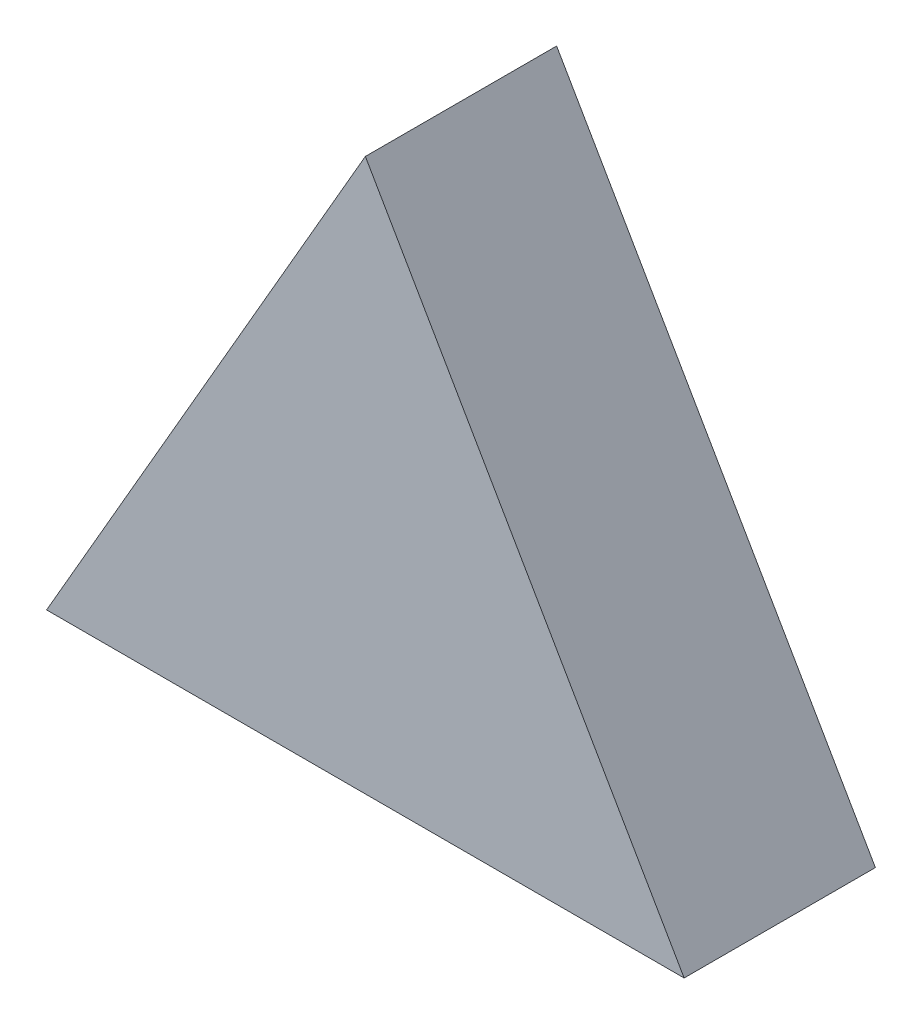
ISO-10303-21;
HEADER;
FILE_DESCRIPTION(('STEP AP214'),'2;1');
FILE_NAME('part.step','',(''),(''),'','','');
FILE_SCHEMA(('AUTOMOTIVE_DESIGN { 1 0 10303 214 1 1 1 1 }'));
ENDSEC;
DATA;
#1=APPLICATION_CONTEXT('core data for automotive mechanical design processes');
#2=APPLICATION_PROTOCOL_DEFINITION('international standard','automotive_design',2000,#1);
#3=PRODUCT_CONTEXT('',#1,'mechanical');
#4=PRODUCT('Part','Part','',(#3));
#5=PRODUCT_RELATED_PRODUCT_CATEGORY('part','',(#4));
#6=PRODUCT_DEFINITION_FORMATION('','',#4);
#7=PRODUCT_DEFINITION_CONTEXT('part definition',#1,'design');
#8=PRODUCT_DEFINITION('design','',#6,#7);
#9=PRODUCT_DEFINITION_SHAPE('','',#8);
#10=(LENGTH_UNIT() NAMED_UNIT(*) SI_UNIT(.MILLI.,.METRE.));
#11=(NAMED_UNIT(*) PLANE_ANGLE_UNIT() SI_UNIT($,.RADIAN.));
#12=(NAMED_UNIT(*) SI_UNIT($,.STERADIAN.) SOLID_ANGLE_UNIT());
#13=UNCERTAINTY_MEASURE_WITH_UNIT(LENGTH_MEASURE(1.E-05),#10,'distance_accuracy_value','');
#14=(GEOMETRIC_REPRESENTATION_CONTEXT(3) GLOBAL_UNCERTAINTY_ASSIGNED_CONTEXT((#13)) GLOBAL_UNIT_ASSIGNED_CONTEXT((#10,
#11,#12)) REPRESENTATION_CONTEXT('',''));
#15=CARTESIAN_POINT('',(0.,0.,0.));
#16=DIRECTION('',(0.,0.,1.));
#17=DIRECTION('',(1.,0.,0.));
#18=AXIS2_PLACEMENT_3D('',#15,#16,#17);
#19=CARTESIAN_POINT('',(-10.,0.,6.));
#20=DIRECTION('',(0.866025403784438,-0.500000000000001,0.));
#21=DIRECTION('',(0.500000000000001,0.866025403784438,0.));
#22=AXIS2_PLACEMENT_3D('',#19,#20,#21);
#23=PLANE('',#22);
#24=DIRECTION('',(-0.500000000000001,-0.866025403784438,0.));
#25=VECTOR('',#24,1.);
#26=CARTESIAN_POINT('',(-10.,0.,0.));
#27=LINE('',#26,#25);
#28=CARTESIAN_POINT('',(0.,17.3205080756888,0.));
#29=VERTEX_POINT('',#28);
#30=CARTESIAN_POINT('',(-10.,0.,0.));
#31=VERTEX_POINT('',#30);
#32=EDGE_CURVE('E89',#29,#31,#27,.T.);
#33=ORIENTED_EDGE('',*,*,#32,.T.);
#34=DIRECTION('',(0.,0.,-1.));
#35=VECTOR('',#34,1.);
#36=CARTESIAN_POINT('',(-10.,0.,6.));
#37=LINE('',#36,#35);
#38=CARTESIAN_POINT('',(-10.,0.,6.));
#39=VERTEX_POINT('',#38);
#40=EDGE_CURVE('E11',#39,#31,#37,.T.);
#41=ORIENTED_EDGE('',*,*,#40,.F.);
#42=DIRECTION('',(-0.500000000000001,-0.866025403784438,0.));
#43=VECTOR('',#42,1.);
#44=CARTESIAN_POINT('',(-10.,0.,6.));
#45=LINE('',#44,#43);
#46=CARTESIAN_POINT('',(0.,17.3205080756888,6.));
#47=VERTEX_POINT('',#46);
#48=EDGE_CURVE('E81',#47,#39,#45,.T.);
#49=ORIENTED_EDGE('',*,*,#48,.F.);
#50=DIRECTION('',(0.,0.,-1.));
#51=VECTOR('',#50,1.);
#52=CARTESIAN_POINT('',(0.,17.3205080756888,6.));
#53=LINE('',#52,#51);
#54=EDGE_CURVE('E90',#47,#29,#53,.T.);
#55=ORIENTED_EDGE('',*,*,#54,.T.);
#56=EDGE_LOOP('',(#33,#41,#49,#55));
#57=FACE_BOUND('',#56,.T.);
#58=ADVANCED_FACE('F39',(#57),#23,.F.);
#59=CARTESIAN_POINT('',(10.,0.,6.));
#60=DIRECTION('',(0.,1.,0.));
#61=DIRECTION('',(0.,0.,1.));
#62=AXIS2_PLACEMENT_3D('',#59,#60,#61);
#63=PLANE('',#62);
#64=DIRECTION('',(1.,0.,0.));
#65=VECTOR('',#64,1.);
#66=CARTESIAN_POINT('',(10.,0.,0.));
#67=LINE('',#66,#65);
#68=CARTESIAN_POINT('',(10.,0.,0.));
#69=VERTEX_POINT('',#68);
#70=EDGE_CURVE('E68',#31,#69,#67,.T.);
#71=ORIENTED_EDGE('',*,*,#70,.T.);
#72=DIRECTION('',(0.,0.,-1.));
#73=VECTOR('',#72,1.);
#74=CARTESIAN_POINT('',(10.,0.,6.));
#75=LINE('',#74,#73);
#76=CARTESIAN_POINT('',(10.,0.,6.));
#77=VERTEX_POINT('',#76);
#78=EDGE_CURVE('E48',#77,#69,#75,.T.);
#79=ORIENTED_EDGE('',*,*,#78,.F.);
#80=DIRECTION('',(1.,0.,0.));
#81=VECTOR('',#80,1.);
#82=CARTESIAN_POINT('',(10.,0.,6.));
#83=LINE('',#82,#81);
#84=EDGE_CURVE('E76',#39,#77,#83,.T.);
#85=ORIENTED_EDGE('',*,*,#84,.F.);
#86=ORIENTED_EDGE('',*,*,#40,.T.);
#87=EDGE_LOOP('',(#71,#79,#85,#86));
#88=FACE_BOUND('',#87,.T.);
#89=ADVANCED_FACE('F77',(#88),#63,.F.);
#90=CARTESIAN_POINT('',(0.,17.3205080756888,6.));
#91=DIRECTION('',(-0.866025403784438,-0.500000000000001,0.));
#92=DIRECTION('',(0.500000000000001,-0.866025403784438,0.));
#93=AXIS2_PLACEMENT_3D('',#90,#91,#92);
#94=PLANE('',#93);
#95=DIRECTION('',(-0.500000000000001,0.866025403784438,0.));
#96=VECTOR('',#95,1.);
#97=CARTESIAN_POINT('',(0.,17.3205080756888,0.));
#98=LINE('',#97,#96);
#99=EDGE_CURVE('E73',#69,#29,#98,.T.);
#100=ORIENTED_EDGE('',*,*,#99,.T.);
#101=ORIENTED_EDGE('',*,*,#54,.F.);
#102=DIRECTION('',(-0.500000000000001,0.866025403784438,0.));
#103=VECTOR('',#102,1.);
#104=CARTESIAN_POINT('',(0.,17.3205080756888,6.));
#105=LINE('',#104,#103);
#106=EDGE_CURVE('E56',#77,#47,#105,.T.);
#107=ORIENTED_EDGE('',*,*,#106,.F.);
#108=ORIENTED_EDGE('',*,*,#78,.T.);
#109=EDGE_LOOP('',(#100,#101,#107,#108));
#110=FACE_BOUND('',#109,.T.);
#111=ADVANCED_FACE('F102',(#110),#94,.F.);
#112=CARTESIAN_POINT('',(0.,0.,6.));
#113=DIRECTION('',(0.,0.,-1.));
#114=DIRECTION('',(-1.,0.,0.));
#115=AXIS2_PLACEMENT_3D('',#112,#113,#114);
#116=PLANE('',#115);
#117=ORIENTED_EDGE('',*,*,#48,.T.);
#118=ORIENTED_EDGE('',*,*,#84,.T.);
#119=ORIENTED_EDGE('',*,*,#106,.T.);
#120=EDGE_LOOP('',(#117,#118,#119));
#121=FACE_BOUND('',#120,.T.);
#122=ADVANCED_FACE('F84',(#121),#116,.F.);
#123=CARTESIAN_POINT('',(0.,0.,0.));
#124=DIRECTION('',(0.,0.,-1.));
#125=DIRECTION('',(-1.,0.,0.));
#126=AXIS2_PLACEMENT_3D('',#123,#124,#125);
#127=PLANE('',#126);
#128=ORIENTED_EDGE('',*,*,#32,.F.);
#129=ORIENTED_EDGE('',*,*,#99,.F.);
#130=ORIENTED_EDGE('',*,*,#70,.F.);
#131=EDGE_LOOP('',(#128,#129,#130));
#132=FACE_BOUND('',#131,.T.);
#133=ADVANCED_FACE('F103',(#132),#127,.T.);
#134=CLOSED_SHELL('',(#58,#89,#111,#122,#133));
#135=MANIFOLD_SOLID_BREP('B2',#134);
#136=ADVANCED_BREP_SHAPE_REPRESENTATION('',(#18,#135),#14);
#137=SHAPE_DEFINITION_REPRESENTATION(#9,#136);
ENDSEC;
END-ISO-10303-21;
